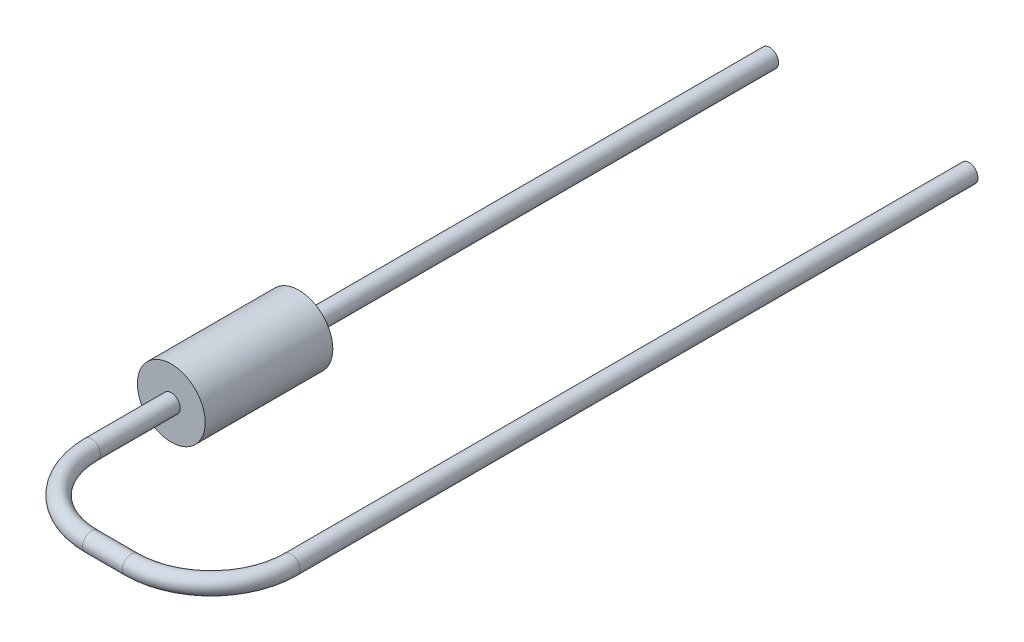
ISO-10303-21;
HEADER;
FILE_DESCRIPTION(('STEP AP214'),'2;1');
FILE_NAME('part.step','',(''),(''),'','','');
FILE_SCHEMA(('AUTOMOTIVE_DESIGN { 1 0 10303 214 1 1 1 1 }'));
ENDSEC;
DATA;
#1=APPLICATION_CONTEXT('core data for automotive mechanical design processes');
#2=APPLICATION_PROTOCOL_DEFINITION('international standard','automotive_design',2000,#1);
#3=PRODUCT_CONTEXT('',#1,'mechanical');
#4=PRODUCT('Part','Part','',(#3));
#5=PRODUCT_RELATED_PRODUCT_CATEGORY('part','',(#4));
#6=PRODUCT_DEFINITION_FORMATION('','',#4);
#7=PRODUCT_DEFINITION_CONTEXT('part definition',#1,'design');
#8=PRODUCT_DEFINITION('design','',#6,#7);
#9=PRODUCT_DEFINITION_SHAPE('','',#8);
#10=(LENGTH_UNIT() NAMED_UNIT(*) SI_UNIT(.MILLI.,.METRE.));
#11=(NAMED_UNIT(*) PLANE_ANGLE_UNIT() SI_UNIT($,.RADIAN.));
#12=(NAMED_UNIT(*) SI_UNIT($,.STERADIAN.) SOLID_ANGLE_UNIT());
#13=UNCERTAINTY_MEASURE_WITH_UNIT(LENGTH_MEASURE(1.E-05),#10,'distance_accuracy_value','');
#14=(GEOMETRIC_REPRESENTATION_CONTEXT(3) GLOBAL_UNCERTAINTY_ASSIGNED_CONTEXT((#13)) GLOBAL_UNIT_ASSIGNED_CONTEXT((#10,
#11,#12)) REPRESENTATION_CONTEXT('',''));
#15=CARTESIAN_POINT('',(0.,0.,0.));
#16=DIRECTION('',(0.,0.,1.));
#17=DIRECTION('',(1.,0.,0.));
#18=AXIS2_PLACEMENT_3D('',#15,#16,#17);
#19=CARTESIAN_POINT('',(0.,0.,0.));
#20=DIRECTION('',(0.,0.,1.));
#21=DIRECTION('',(1.,0.,0.));
#22=AXIS2_PLACEMENT_3D('',#19,#20,#21);
#23=PLANE('',#22);
#24=CARTESIAN_POINT('',(0.,0.,0.));
#25=DIRECTION('',(0.,0.,1.));
#26=DIRECTION('',(1.,0.,0.));
#27=AXIS2_PLACEMENT_3D('',#24,#25,#26);
#28=CIRCLE('',#27,0.85);
#29=CARTESIAN_POINT('',(0.85,0.,0.));
#30=VERTEX_POINT('',#29);
#31=EDGE_CURVE('E47',#30,#30,#28,.T.);
#32=ORIENTED_EDGE('',*,*,#31,.F.);
#33=EDGE_LOOP('',(#32));
#34=FACE_BOUND('',#33,.T.);
#35=CARTESIAN_POINT('',(0.,0.,0.));
#36=DIRECTION('',(0.,0.,1.));
#37=DIRECTION('',(1.,0.,0.));
#38=AXIS2_PLACEMENT_3D('',#35,#36,#37);
#39=CIRCLE('',#38,0.225);
#40=CARTESIAN_POINT('',(0.225,0.,0.));
#41=VERTEX_POINT('',#40);
#42=EDGE_CURVE('E10',#41,#41,#39,.F.);
#43=ORIENTED_EDGE('',*,*,#42,.F.);
#44=EDGE_LOOP('',(#43));
#45=FACE_BOUND('',#44,.T.);
#46=ADVANCED_FACE('F31',(#34,#45),#23,.F.);
#47=CARTESIAN_POINT('',(0.,0.,3.2));
#48=DIRECTION('',(0.,0.,-1.));
#49=DIRECTION('',(-1.,0.,0.));
#50=AXIS2_PLACEMENT_3D('',#47,#48,#49);
#51=CYLINDRICAL_SURFACE('',#50,0.85);
#52=CARTESIAN_POINT('',(0.,0.,3.2));
#53=DIRECTION('',(0.,0.,1.));
#54=DIRECTION('',(1.,0.,0.));
#55=AXIS2_PLACEMENT_3D('',#52,#53,#54);
#56=CIRCLE('',#55,0.85);
#57=CARTESIAN_POINT('',(0.85,0.,3.2));
#58=VERTEX_POINT('',#57);
#59=EDGE_CURVE('E42',#58,#58,#56,.T.);
#60=ORIENTED_EDGE('',*,*,#59,.F.);
#61=EDGE_LOOP('',(#60));
#62=FACE_BOUND('',#61,.T.);
#63=ORIENTED_EDGE('',*,*,#31,.T.);
#64=EDGE_LOOP('',(#63));
#65=FACE_BOUND('',#64,.T.);
#66=ADVANCED_FACE('F33',(#62,#65),#51,.T.);
#67=CARTESIAN_POINT('',(0.,0.,3.2));
#68=DIRECTION('',(0.,0.,1.));
#69=DIRECTION('',(1.,0.,0.));
#70=AXIS2_PLACEMENT_3D('',#67,#68,#69);
#71=PLANE('',#70);
#72=CARTESIAN_POINT('',(0.,0.,3.2));
#73=DIRECTION('',(0.,0.,1.));
#74=DIRECTION('',(1.,0.,0.));
#75=AXIS2_PLACEMENT_3D('',#72,#73,#74);
#76=CIRCLE('',#75,0.225);
#77=CARTESIAN_POINT('',(0.225,0.,3.2));
#78=VERTEX_POINT('',#77);
#79=EDGE_CURVE('E38',#78,#78,#76,.T.);
#80=ORIENTED_EDGE('',*,*,#79,.F.);
#81=EDGE_LOOP('',(#80));
#82=FACE_BOUND('',#81,.T.);
#83=ORIENTED_EDGE('',*,*,#59,.T.);
#84=EDGE_LOOP('',(#83));
#85=FACE_BOUND('',#84,.T.);
#86=ADVANCED_FACE('F73',(#82,#85),#71,.T.);
#87=CARTESIAN_POINT('',(5.,0.,5.2));
#88=DIRECTION('',(0.,0.,-1.));
#89=DIRECTION('',(-1.,0.,0.));
#90=AXIS2_PLACEMENT_3D('',#87,#88,#89);
#91=CYLINDRICAL_SURFACE('',#90,0.225);
#92=CARTESIAN_POINT('',(5.,0.,5.2));
#93=DIRECTION('',(0.,0.,-1.));
#94=DIRECTION('',(-1.,0.,0.));
#95=AXIS2_PLACEMENT_3D('',#92,#93,#94);
#96=CIRCLE('',#95,0.225);
#97=CARTESIAN_POINT('',(5.225,0.,5.2));
#98=VERTEX_POINT('',#97);
#99=EDGE_CURVE('E59',#98,#98,#96,.T.);
#100=ORIENTED_EDGE('',*,*,#99,.T.);
#101=EDGE_LOOP('',(#100));
#102=FACE_BOUND('',#101,.T.);
#103=CARTESIAN_POINT('',(5.,0.,-11.8));
#104=DIRECTION('',(0.,0.,-1.));
#105=DIRECTION('',(-1.,0.,0.));
#106=AXIS2_PLACEMENT_3D('',#103,#104,#105);
#107=CIRCLE('',#106,0.225);
#108=CARTESIAN_POINT('',(4.775,0.,-11.8));
#109=VERTEX_POINT('',#108);
#110=EDGE_CURVE('E62',#109,#109,#107,.T.);
#111=ORIENTED_EDGE('',*,*,#110,.F.);
#112=EDGE_LOOP('',(#111));
#113=FACE_BOUND('',#112,.T.);
#114=ADVANCED_FACE('F78',(#102,#113),#91,.T.);
#115=CARTESIAN_POINT('',(3.,0.,5.2));
#116=DIRECTION('',(0.,1.,0.));
#117=DIRECTION('',(0.,0.,1.));
#118=AXIS2_PLACEMENT_3D('',#115,#116,#117);
#119=TOROIDAL_SURFACE('',#118,2.,0.225);
#120=CARTESIAN_POINT('',(3.,0.,7.2));
#121=DIRECTION('',(1.,0.,0.));
#122=DIRECTION('',(0.,0.,-1.));
#123=AXIS2_PLACEMENT_3D('',#120,#121,#122);
#124=CIRCLE('',#123,0.225);
#125=CARTESIAN_POINT('',(3.,0.,7.425));
#126=VERTEX_POINT('',#125);
#127=EDGE_CURVE('E56',#126,#126,#124,.T.);
#128=CARTESIAN_POINT('',(3.,0.,5.2));
#129=DIRECTION('',(0.,1.,0.));
#130=DIRECTION('',(0.,0.,1.));
#131=AXIS2_PLACEMENT_3D('',#128,#129,#130);
#132=CIRCLE('',#131,2.225);
#133=EDGE_CURVE('',#126,#98,#132,.T.);
#134=ORIENTED_EDGE('',*,*,#127,.T.);
#135=ORIENTED_EDGE('',*,*,#99,.F.);
#136=ORIENTED_EDGE('',*,*,#133,.T.);
#137=ORIENTED_EDGE('',*,*,#133,.F.);
#138=EDGE_LOOP('',(#134,#136,#135,#137));
#139=FACE_BOUND('',#138,.T.);
#140=ADVANCED_FACE('F82',(#139),#119,.T.);
#141=CARTESIAN_POINT('',(2.,0.,7.2));
#142=DIRECTION('',(1.,0.,0.));
#143=DIRECTION('',(0.,0.,-1.));
#144=AXIS2_PLACEMENT_3D('',#141,#142,#143);
#145=CYLINDRICAL_SURFACE('',#144,0.225);
#146=CARTESIAN_POINT('',(2.,0.,7.2));
#147=DIRECTION('',(1.,0.,0.));
#148=DIRECTION('',(0.,0.,-1.));
#149=AXIS2_PLACEMENT_3D('',#146,#147,#148);
#150=CIRCLE('',#149,0.225);
#151=CARTESIAN_POINT('',(2.,0.,7.425));
#152=VERTEX_POINT('',#151);
#153=EDGE_CURVE('E53',#152,#152,#150,.T.);
#154=ORIENTED_EDGE('',*,*,#153,.T.);
#155=EDGE_LOOP('',(#154));
#156=FACE_BOUND('',#155,.T.);
#157=ORIENTED_EDGE('',*,*,#127,.F.);
#158=EDGE_LOOP('',(#157));
#159=FACE_BOUND('',#158,.T.);
#160=ADVANCED_FACE('F86',(#156,#159),#145,.T.);
#161=CARTESIAN_POINT('',(2.,0.,5.2));
#162=DIRECTION('',(0.,1.,0.));
#163=DIRECTION('',(0.,0.,1.));
#164=AXIS2_PLACEMENT_3D('',#161,#162,#163);
#165=TOROIDAL_SURFACE('',#164,2.,0.225);
#166=CARTESIAN_POINT('',(0.,0.,5.2));
#167=DIRECTION('',(0.,0.,1.));
#168=DIRECTION('',(1.,0.,0.));
#169=AXIS2_PLACEMENT_3D('',#166,#167,#168);
#170=CIRCLE('',#169,0.225);
#171=CARTESIAN_POINT('',(-0.225000000000001,0.,5.2));
#172=VERTEX_POINT('',#171);
#173=EDGE_CURVE('E51',#172,#172,#170,.T.);
#174=CARTESIAN_POINT('',(2.,0.,5.2));
#175=DIRECTION('',(0.,1.,0.));
#176=DIRECTION('',(0.,0.,1.));
#177=AXIS2_PLACEMENT_3D('',#174,#175,#176);
#178=CIRCLE('',#177,2.225);
#179=EDGE_CURVE('',#172,#152,#178,.T.);
#180=ORIENTED_EDGE('',*,*,#173,.T.);
#181=ORIENTED_EDGE('',*,*,#153,.F.);
#182=ORIENTED_EDGE('',*,*,#179,.T.);
#183=ORIENTED_EDGE('',*,*,#179,.F.);
#184=EDGE_LOOP('',(#180,#182,#181,#183));
#185=FACE_BOUND('',#184,.T.);
#186=ADVANCED_FACE('F90',(#185),#165,.T.);
#187=CARTESIAN_POINT('',(0.,0.,5.2));
#188=DIRECTION('',(0.,0.,-1.));
#189=DIRECTION('',(-1.,0.,0.));
#190=AXIS2_PLACEMENT_3D('',#187,#188,#189);
#191=CYLINDRICAL_SURFACE('',#190,0.225);
#192=ORIENTED_EDGE('',*,*,#173,.F.);
#193=EDGE_LOOP('',(#192));
#194=FACE_BOUND('',#193,.T.);
#195=ORIENTED_EDGE('',*,*,#79,.T.);
#196=EDGE_LOOP('',(#195));
#197=FACE_BOUND('',#196,.T.);
#198=ADVANCED_FACE('F94',(#194,#197),#191,.T.);
#199=CARTESIAN_POINT('',(5.,0.,-11.8));
#200=DIRECTION('',(0.,0.,-1.));
#201=DIRECTION('',(-1.,0.,0.));
#202=AXIS2_PLACEMENT_3D('',#199,#200,#201);
#203=PLANE('',#202);
#204=ORIENTED_EDGE('',*,*,#110,.T.);
#205=EDGE_LOOP('',(#204));
#206=FACE_BOUND('',#205,.T.);
#207=ADVANCED_FACE('F98',(#206),#203,.T.);
#208=CARTESIAN_POINT('',(0.,0.,-12.4363961030679));
#209=DIRECTION('',(0.,0.,1.));
#210=DIRECTION('',(1.,0.,0.));
#211=AXIS2_PLACEMENT_3D('',#208,#209,#210);
#212=CYLINDRICAL_SURFACE('',#211,0.225);
#213=ORIENTED_EDGE('',*,*,#42,.T.);
#214=EDGE_LOOP('',(#213));
#215=FACE_BOUND('',#214,.T.);
#216=CARTESIAN_POINT('',(0.,0.,-11.8));
#217=DIRECTION('',(0.,0.,-1.));
#218=DIRECTION('',(-1.,0.,0.));
#219=AXIS2_PLACEMENT_3D('',#216,#217,#218);
#220=CIRCLE('',#219,0.225);
#221=CARTESIAN_POINT('',(-0.225,0.,-11.8));
#222=VERTEX_POINT('',#221);
#223=EDGE_CURVE('E114',#222,#222,#220,.T.);
#224=ORIENTED_EDGE('',*,*,#223,.F.);
#225=EDGE_LOOP('',(#224));
#226=FACE_BOUND('',#225,.T.);
#227=ADVANCED_FACE('F102',(#215,#226),#212,.T.);
#228=CARTESIAN_POINT('',(5.,0.,-11.8));
#229=DIRECTION('',(0.,0.,-1.));
#230=DIRECTION('',(-1.,0.,0.));
#231=AXIS2_PLACEMENT_3D('',#228,#229,#230);
#232=PLANE('',#231);
#233=ORIENTED_EDGE('',*,*,#223,.T.);
#234=EDGE_LOOP('',(#233));
#235=FACE_BOUND('',#234,.T.);
#236=ADVANCED_FACE('F104',(#235),#232,.T.);
#237=CLOSED_SHELL('',(#46,#66,#86,#114,#140,#160,#186,#198,#207,#227,#236));
#238=MANIFOLD_SOLID_BREP('B2',#237);
#239=ADVANCED_BREP_SHAPE_REPRESENTATION('',(#18,#238),#14);
#240=SHAPE_DEFINITION_REPRESENTATION(#9,#239);
ENDSEC;
END-ISO-10303-21;
